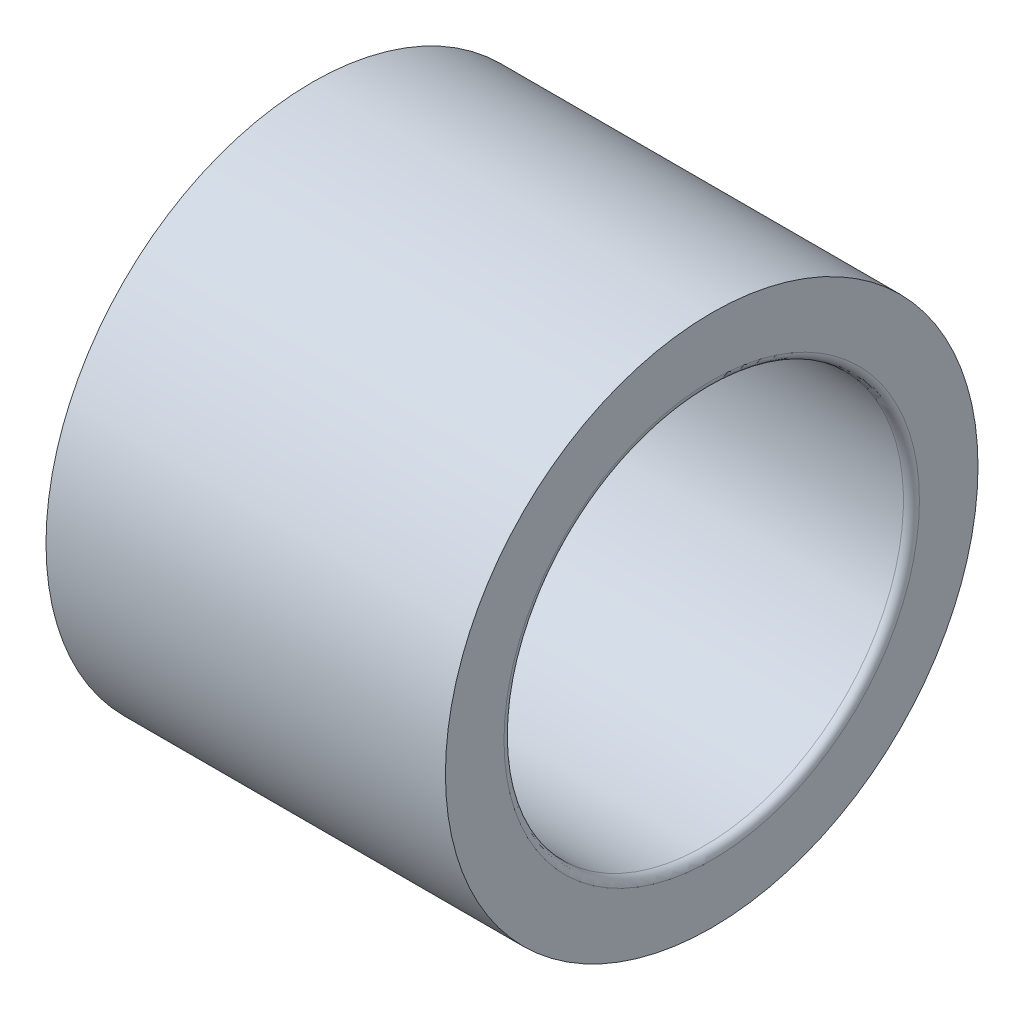
ISO-10303-21;
HEADER;
FILE_DESCRIPTION(('STEP AP214'),'2;1');
FILE_NAME('part.step','',(''),(''),'','','');
FILE_SCHEMA(('AUTOMOTIVE_DESIGN { 1 0 10303 214 1 1 1 1 }'));
ENDSEC;
DATA;
#1=APPLICATION_CONTEXT('core data for automotive mechanical design processes');
#2=APPLICATION_PROTOCOL_DEFINITION('international standard','automotive_design',2000,#1);
#3=PRODUCT_CONTEXT('',#1,'mechanical');
#4=PRODUCT('Part','Part','',(#3));
#5=PRODUCT_RELATED_PRODUCT_CATEGORY('part','',(#4));
#6=PRODUCT_DEFINITION_FORMATION('','',#4);
#7=PRODUCT_DEFINITION_CONTEXT('part definition',#1,'design');
#8=PRODUCT_DEFINITION('design','',#6,#7);
#9=PRODUCT_DEFINITION_SHAPE('','',#8);
#10=(LENGTH_UNIT() NAMED_UNIT(*) SI_UNIT(.MILLI.,.METRE.));
#11=(NAMED_UNIT(*) PLANE_ANGLE_UNIT() SI_UNIT($,.RADIAN.));
#12=(NAMED_UNIT(*) SI_UNIT($,.STERADIAN.) SOLID_ANGLE_UNIT());
#13=UNCERTAINTY_MEASURE_WITH_UNIT(LENGTH_MEASURE(1.E-05),#10,'distance_accuracy_value','');
#14=(GEOMETRIC_REPRESENTATION_CONTEXT(3) GLOBAL_UNCERTAINTY_ASSIGNED_CONTEXT((#13)) GLOBAL_UNIT_ASSIGNED_CONTEXT((#10,
#11,#12)) REPRESENTATION_CONTEXT('',''));
#15=CARTESIAN_POINT('',(0.,0.,0.));
#16=DIRECTION('',(0.,0.,1.));
#17=DIRECTION('',(1.,0.,0.));
#18=AXIS2_PLACEMENT_3D('',#15,#16,#17);
#19=CARTESIAN_POINT('',(1602.5,0.,0.));
#20=DIRECTION('',(1.,0.,0.));
#21=DIRECTION('',(0.,0.,-1.));
#22=AXIS2_PLACEMENT_3D('',#19,#20,#21);
#23=CYLINDRICAL_SURFACE('',#22,7.5);
#24=CARTESIAN_POINT('',(1595.3,0.,0.));
#25=DIRECTION('',(-1.,0.,0.));
#26=DIRECTION('',(0.,0.,1.));
#27=AXIS2_PLACEMENT_3D('',#24,#25,#26);
#28=CIRCLE('',#27,7.5);
#29=CARTESIAN_POINT('',(1595.3,0.,7.5));
#30=VERTEX_POINT('',#29);
#31=EDGE_CURVE('E59',#30,#30,#28,.F.);
#32=ORIENTED_EDGE('',*,*,#31,.F.);
#33=EDGE_LOOP('',(#32));
#34=FACE_BOUND('',#33,.T.);
#35=CARTESIAN_POINT('',(1609.7,0.,0.));
#36=DIRECTION('',(-1.,0.,0.));
#37=DIRECTION('',(0.,0.,1.));
#38=AXIS2_PLACEMENT_3D('',#35,#36,#37);
#39=CIRCLE('',#38,7.5);
#40=CARTESIAN_POINT('',(1609.7,0.,7.5));
#41=VERTEX_POINT('',#40);
#42=EDGE_CURVE('E253',#41,#41,#39,.T.);
#43=ORIENTED_EDGE('',*,*,#42,.F.);
#44=EDGE_LOOP('',(#43));
#45=FACE_BOUND('',#44,.T.);
#46=ADVANCED_FACE('F16',(#34,#45),#23,.F.);
#47=CARTESIAN_POINT('',(1609.7,0.,0.));
#48=DIRECTION('',(-1.,0.,0.));
#49=DIRECTION('',(0.,0.,1.));
#50=AXIS2_PLACEMENT_3D('',#47,#48,#49);
#51=TOROIDAL_SURFACE('',#50,7.8,0.300000000000001);
#52=ORIENTED_EDGE('',*,*,#42,.T.);
#53=EDGE_LOOP('',(#52));
#54=FACE_BOUND('',#53,.T.);
#55=CARTESIAN_POINT('',(1610.,0.,0.));
#56=DIRECTION('',(1.,0.,0.));
#57=DIRECTION('',(0.,0.,-1.));
#58=AXIS2_PLACEMENT_3D('',#55,#56,#57);
#59=CIRCLE('',#58,7.8);
#60=CARTESIAN_POINT('',(1610.,7.8,0.));
#61=VERTEX_POINT('',#60);
#62=CARTESIAN_POINT('',(1610.,0.,-7.8));
#63=VERTEX_POINT('',#62);
#64=EDGE_CURVE('E51',#61,#63,#59,.F.);
#65=ORIENTED_EDGE('',*,*,#64,.F.);
#66=CARTESIAN_POINT('',(1610.,0.,0.));
#67=DIRECTION('',(1.,0.,0.));
#68=DIRECTION('',(0.,1.,0.));
#69=AXIS2_PLACEMENT_3D('',#66,#67,#68);
#70=CIRCLE('',#69,7.8);
#71=CARTESIAN_POINT('',(1610.,0.,7.8));
#72=VERTEX_POINT('',#71);
#73=EDGE_CURVE('E55',#72,#61,#70,.F.);
#74=ORIENTED_EDGE('',*,*,#73,.F.);
#75=CARTESIAN_POINT('',(1610.,0.,0.));
#76=DIRECTION('',(1.,0.,0.));
#77=DIRECTION('',(0.,0.,1.));
#78=AXIS2_PLACEMENT_3D('',#75,#76,#77);
#79=CIRCLE('',#78,7.8);
#80=EDGE_CURVE('E49',#63,#72,#79,.F.);
#81=ORIENTED_EDGE('',*,*,#80,.F.);
#82=EDGE_LOOP('',(#65,#74,#81));
#83=FACE_BOUND('',#82,.T.);
#84=ADVANCED_FACE('F54',(#54,#83),#51,.T.);
#85=CARTESIAN_POINT('',(1595.3,0.,0.));
#86=DIRECTION('',(-1.,0.,0.));
#87=DIRECTION('',(0.,0.,1.));
#88=AXIS2_PLACEMENT_3D('',#85,#86,#87);
#89=TOROIDAL_SURFACE('',#88,7.8,0.3);
#90=ORIENTED_EDGE('',*,*,#31,.T.);
#91=EDGE_LOOP('',(#90));
#92=FACE_BOUND('',#91,.T.);
#93=CARTESIAN_POINT('',(1595.,0.,0.));
#94=DIRECTION('',(-1.,0.,0.));
#95=DIRECTION('',(0.,0.,-1.));
#96=AXIS2_PLACEMENT_3D('',#93,#94,#95);
#97=CIRCLE('',#96,7.8);
#98=CARTESIAN_POINT('',(1595.,0.,7.8));
#99=VERTEX_POINT('',#98);
#100=CARTESIAN_POINT('',(1595.,0.,-7.8));
#101=VERTEX_POINT('',#100);
#102=EDGE_CURVE('E35',#99,#101,#97,.F.);
#103=ORIENTED_EDGE('',*,*,#102,.F.);
#104=CARTESIAN_POINT('',(1595.,0.,0.));
#105=DIRECTION('',(-1.,0.,0.));
#106=DIRECTION('',(0.,0.,1.));
#107=AXIS2_PLACEMENT_3D('',#104,#105,#106);
#108=CIRCLE('',#107,7.8);
#109=CARTESIAN_POINT('',(1595.,7.8,0.));
#110=VERTEX_POINT('',#109);
#111=EDGE_CURVE('E121',#110,#99,#108,.F.);
#112=ORIENTED_EDGE('',*,*,#111,.F.);
#113=CARTESIAN_POINT('',(1595.,0.,0.));
#114=DIRECTION('',(-1.,0.,0.));
#115=DIRECTION('',(0.,1.,0.));
#116=AXIS2_PLACEMENT_3D('',#113,#114,#115);
#117=CIRCLE('',#116,7.8);
#118=EDGE_CURVE('E66',#101,#110,#117,.F.);
#119=ORIENTED_EDGE('',*,*,#118,.F.);
#120=EDGE_LOOP('',(#103,#112,#119));
#121=FACE_BOUND('',#120,.T.);
#122=ADVANCED_FACE('F86',(#92,#121),#89,.T.);
#123=CARTESIAN_POINT('',(1610.,8.9,0.));
#124=DIRECTION('',(1.,0.,0.));
#125=DIRECTION('',(0.,0.,-1.));
#126=AXIS2_PLACEMENT_3D('',#123,#124,#125);
#127=PLANE('',#126);
#128=ORIENTED_EDGE('',*,*,#80,.T.);
#129=ORIENTED_EDGE('',*,*,#73,.T.);
#130=ORIENTED_EDGE('',*,*,#64,.T.);
#131=EDGE_LOOP('',(#128,#129,#130));
#132=FACE_BOUND('',#131,.T.);
#133=CARTESIAN_POINT('',(1610.,0.,0.));
#134=DIRECTION('',(1.,0.,0.));
#135=DIRECTION('',(0.,0.,-1.));
#136=AXIS2_PLACEMENT_3D('',#133,#134,#135);
#137=CIRCLE('',#136,10.);
#138=CARTESIAN_POINT('',(1610.,0.,-10.));
#139=VERTEX_POINT('',#138);
#140=EDGE_CURVE('E26',#139,#139,#137,.F.);
#141=ORIENTED_EDGE('',*,*,#140,.F.);
#142=EDGE_LOOP('',(#141));
#143=FACE_BOUND('',#142,.T.);
#144=ADVANCED_FACE('F63',(#132,#143),#127,.T.);
#145=CARTESIAN_POINT('',(1595.,8.9,0.));
#146=DIRECTION('',(-1.,0.,0.));
#147=DIRECTION('',(0.,0.,1.));
#148=AXIS2_PLACEMENT_3D('',#145,#146,#147);
#149=PLANE('',#148);
#150=CARTESIAN_POINT('',(1595.,0.,0.));
#151=DIRECTION('',(1.,0.,0.));
#152=DIRECTION('',(0.,0.,-1.));
#153=AXIS2_PLACEMENT_3D('',#150,#151,#152);
#154=CIRCLE('',#153,10.);
#155=CARTESIAN_POINT('',(1595.,0.,-10.));
#156=VERTEX_POINT('',#155);
#157=EDGE_CURVE('E10',#156,#156,#154,.T.);
#158=ORIENTED_EDGE('',*,*,#157,.F.);
#159=EDGE_LOOP('',(#158));
#160=FACE_BOUND('',#159,.T.);
#161=ORIENTED_EDGE('',*,*,#111,.T.);
#162=ORIENTED_EDGE('',*,*,#102,.T.);
#163=ORIENTED_EDGE('',*,*,#118,.T.);
#164=EDGE_LOOP('',(#161,#162,#163));
#165=FACE_BOUND('',#164,.T.);
#166=ADVANCED_FACE('F85',(#160,#165),#149,.T.);
#167=CARTESIAN_POINT('',(1602.5,0.,0.));
#168=DIRECTION('',(1.,0.,0.));
#169=DIRECTION('',(0.,0.,-1.));
#170=AXIS2_PLACEMENT_3D('',#167,#168,#169);
#171=CYLINDRICAL_SURFACE('',#170,10.);
#172=ORIENTED_EDGE('',*,*,#140,.T.);
#173=EDGE_LOOP('',(#172));
#174=FACE_BOUND('',#173,.T.);
#175=ORIENTED_EDGE('',*,*,#157,.T.);
#176=EDGE_LOOP('',(#175));
#177=FACE_BOUND('',#176,.T.);
#178=ADVANCED_FACE('F161',(#174,#177),#171,.T.);
#179=CLOSED_SHELL('',(#46,#84,#122,#144,#166,#178));
#180=MANIFOLD_SOLID_BREP('B1',#179);
#181=ADVANCED_BREP_SHAPE_REPRESENTATION('',(#18,#180),#14);
#182=SHAPE_DEFINITION_REPRESENTATION(#9,#181);
ENDSEC;
END-ISO-10303-21;
